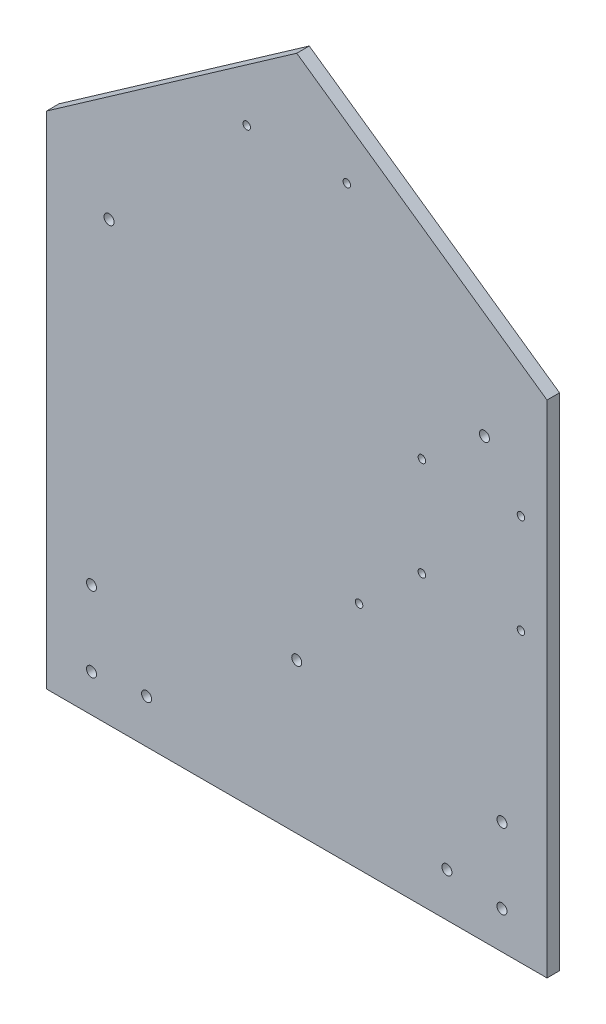
ISO-10303-21;
HEADER;
FILE_DESCRIPTION(('STEP AP214'),'2;1');
FILE_NAME('part.step','',(''),(''),'','','');
FILE_SCHEMA(('AUTOMOTIVE_DESIGN { 1 0 10303 214 1 1 1 1 }'));
ENDSEC;
DATA;
#1=APPLICATION_CONTEXT('core data for automotive mechanical design processes');
#2=APPLICATION_PROTOCOL_DEFINITION('international standard','automotive_design',2000,#1);
#3=PRODUCT_CONTEXT('',#1,'mechanical');
#4=PRODUCT('Part','Part','',(#3));
#5=PRODUCT_RELATED_PRODUCT_CATEGORY('part','',(#4));
#6=PRODUCT_DEFINITION_FORMATION('','',#4);
#7=PRODUCT_DEFINITION_CONTEXT('part definition',#1,'design');
#8=PRODUCT_DEFINITION('design','',#6,#7);
#9=PRODUCT_DEFINITION_SHAPE('','',#8);
#10=(LENGTH_UNIT() NAMED_UNIT(*) SI_UNIT(.MILLI.,.METRE.));
#11=(NAMED_UNIT(*) PLANE_ANGLE_UNIT() SI_UNIT($,.RADIAN.));
#12=(NAMED_UNIT(*) SI_UNIT($,.STERADIAN.) SOLID_ANGLE_UNIT());
#13=UNCERTAINTY_MEASURE_WITH_UNIT(LENGTH_MEASURE(1.E-05),#10,'distance_accuracy_value','');
#14=(GEOMETRIC_REPRESENTATION_CONTEXT(3) GLOBAL_UNCERTAINTY_ASSIGNED_CONTEXT((#13)) GLOBAL_UNIT_ASSIGNED_CONTEXT((#10,
#11,#12)) REPRESENTATION_CONTEXT('',''));
#15=CARTESIAN_POINT('',(0.,0.,0.));
#16=DIRECTION('',(0.,0.,1.));
#17=DIRECTION('',(1.,0.,0.));
#18=AXIS2_PLACEMENT_3D('',#15,#16,#17);
#19=CARTESIAN_POINT('',(0.,0.,5.));
#20=DIRECTION('',(0.,0.,1.));
#21=DIRECTION('',(1.,0.,0.));
#22=AXIS2_PLACEMENT_3D('',#19,#20,#21);
#23=PLANE('',#22);
#24=CARTESIAN_POINT('',(97.1030347467712,19.8717948717949,5.));
#25=DIRECTION('',(0.,0.,1.));
#26=DIRECTION('',(-1.,0.,0.));
#27=AXIS2_PLACEMENT_3D('',#24,#25,#26);
#28=CIRCLE('',#27,1.5);
#29=CARTESIAN_POINT('',(95.6030347467712,19.8717948717949,5.));
#30=VERTEX_POINT('',#29);
#31=EDGE_CURVE('E220',#30,#30,#28,.T.);
#32=ORIENTED_EDGE('',*,*,#31,.F.);
#33=EDGE_LOOP('',(#32));
#34=FACE_BOUND('',#33,.T.);
#35=CARTESIAN_POINT('',(57.5030347467712,19.8717948717949,5.));
#36=DIRECTION('',(0.,0.,1.));
#37=DIRECTION('',(1.,0.,0.));
#38=AXIS2_PLACEMENT_3D('',#35,#36,#37);
#39=CIRCLE('',#38,1.5);
#40=CARTESIAN_POINT('',(59.0030347467712,19.8717948717949,5.));
#41=VERTEX_POINT('',#40);
#42=EDGE_CURVE('E232',#41,#41,#39,.T.);
#43=ORIENTED_EDGE('',*,*,#42,.F.);
#44=EDGE_LOOP('',(#43));
#45=FACE_BOUND('',#44,.T.);
#46=CARTESIAN_POINT('',(-67.4969652532288,79.8717948717949,5.));
#47=DIRECTION('',(0.,0.,1.));
#48=DIRECTION('',(1.,0.,0.));
#49=AXIS2_PLACEMENT_3D('',#46,#47,#48);
#50=CIRCLE('',#49,2.);
#51=CARTESIAN_POINT('',(-65.4969652532288,79.8717948717949,5.));
#52=VERTEX_POINT('',#51);
#53=EDGE_CURVE('E244',#52,#52,#50,.T.);
#54=ORIENTED_EDGE('',*,*,#53,.F.);
#55=EDGE_LOOP('',(#54));
#56=FACE_BOUND('',#55,.T.);
#57=CARTESIAN_POINT('',(-52.4969652532288,-77.6282051282052,5.));
#58=DIRECTION('',(0.,0.,1.));
#59=DIRECTION('',(1.,0.,0.));
#60=AXIS2_PLACEMENT_3D('',#57,#58,#59);
#61=CIRCLE('',#60,2.);
#62=CARTESIAN_POINT('',(-50.4969652532288,-77.6282051282052,5.));
#63=VERTEX_POINT('',#62);
#64=EDGE_CURVE('E256',#63,#63,#61,.T.);
#65=ORIENTED_EDGE('',*,*,#64,.F.);
#66=EDGE_LOOP('',(#65));
#67=FACE_BOUND('',#66,.T.);
#68=CARTESIAN_POINT('',(7.5030347467712,-35.1282051282051,5.));
#69=DIRECTION('',(0.,0.,1.));
#70=DIRECTION('',(1.,0.,0.));
#71=AXIS2_PLACEMENT_3D('',#68,#69,#70);
#72=CIRCLE('',#71,2.);
#73=CARTESIAN_POINT('',(9.5030347467712,-35.1282051282051,5.));
#74=VERTEX_POINT('',#73);
#75=EDGE_CURVE('E268',#74,#74,#72,.T.);
#76=ORIENTED_EDGE('',*,*,#75,.F.);
#77=EDGE_LOOP('',(#76));
#78=FACE_BOUND('',#77,.T.);
#79=CARTESIAN_POINT('',(27.5030347467712,139.871794871795,5.));
#80=DIRECTION('',(0.,0.,1.));
#81=DIRECTION('',(1.,0.,0.));
#82=AXIS2_PLACEMENT_3D('',#79,#80,#81);
#83=CIRCLE('',#82,1.5);
#84=CARTESIAN_POINT('',(29.0030347467712,139.871794871795,5.));
#85=VERTEX_POINT('',#84);
#86=EDGE_CURVE('E280',#85,#85,#83,.T.);
#87=ORIENTED_EDGE('',*,*,#86,.F.);
#88=EDGE_LOOP('',(#87));
#89=FACE_BOUND('',#88,.T.);
#90=CARTESIAN_POINT('',(-74.4969652532289,-50.1282051282052,5.));
#91=DIRECTION('',(0.,0.,1.));
#92=DIRECTION('',(-1.,0.,0.));
#93=AXIS2_PLACEMENT_3D('',#90,#91,#92);
#94=CIRCLE('',#93,2.);
#95=CARTESIAN_POINT('',(-76.4969652532289,-50.1282051282052,5.));
#96=VERTEX_POINT('',#95);
#97=EDGE_CURVE('E292',#96,#96,#94,.T.);
#98=ORIENTED_EDGE('',*,*,#97,.F.);
#99=EDGE_LOOP('',(#98));
#100=FACE_BOUND('',#99,.T.);
#101=CARTESIAN_POINT('',(-74.4969652532289,-80.1282051282052,5.));
#102=DIRECTION('',(0.,0.,1.));
#103=DIRECTION('',(-1.,0.,0.));
#104=AXIS2_PLACEMENT_3D('',#101,#102,#103);
#105=CIRCLE('',#104,2.);
#106=CARTESIAN_POINT('',(-76.4969652532289,-80.1282051282052,5.));
#107=VERTEX_POINT('',#106);
#108=EDGE_CURVE('E112',#107,#107,#105,.T.);
#109=ORIENTED_EDGE('',*,*,#108,.F.);
#110=EDGE_LOOP('',(#109));
#111=FACE_BOUND('',#110,.T.);
#112=DIRECTION('',(0.,1.,0.));
#113=VECTOR('',#112,1.);
#114=CARTESIAN_POINT('',(107.503034746771,104.871794871795,5.));
#115=LINE('',#114,#113);
#116=CARTESIAN_POINT('',(107.503034746771,-95.1282051282052,5.));
#117=VERTEX_POINT('',#116);
#118=CARTESIAN_POINT('',(107.503034746771,104.871794871795,5.));
#119=VERTEX_POINT('',#118);
#120=EDGE_CURVE('E117',#117,#119,#115,.T.);
#121=ORIENTED_EDGE('',*,*,#120,.T.);
#122=DIRECTION('',(-0.81923192051904,0.573462344363329,0.));
#123=VECTOR('',#122,1.);
#124=CARTESIAN_POINT('',(7.5030347467712,174.871794871795,5.));
#125=LINE('',#124,#123);
#126=CARTESIAN_POINT('',(7.5030347467712,174.871794871795,5.));
#127=VERTEX_POINT('',#126);
#128=EDGE_CURVE('E84',#119,#127,#125,.T.);
#129=ORIENTED_EDGE('',*,*,#128,.T.);
#130=DIRECTION('',(-0.81923192051904,-0.573462344363328,0.));
#131=VECTOR('',#130,1.);
#132=CARTESIAN_POINT('',(-92.4969652532288,104.871794871795,5.));
#133=LINE('',#132,#131);
#134=CARTESIAN_POINT('',(-92.4969652532288,104.871794871795,5.));
#135=VERTEX_POINT('',#134);
#136=EDGE_CURVE('E88',#127,#135,#133,.T.);
#137=ORIENTED_EDGE('',*,*,#136,.T.);
#138=DIRECTION('',(0.,-1.,0.));
#139=VECTOR('',#138,1.);
#140=CARTESIAN_POINT('',(-92.4969652532288,104.871794871795,5.));
#141=LINE('',#140,#139);
#142=CARTESIAN_POINT('',(-92.4969652532288,-95.1282051282052,5.));
#143=VERTEX_POINT('',#142);
#144=EDGE_CURVE('E92',#135,#143,#141,.T.);
#145=ORIENTED_EDGE('',*,*,#144,.T.);
#146=DIRECTION('',(1.,0.,0.));
#147=VECTOR('',#146,1.);
#148=CARTESIAN_POINT('',(-92.4969652532288,-95.1282051282052,5.));
#149=LINE('',#148,#147);
#150=EDGE_CURVE('E50',#143,#117,#149,.T.);
#151=ORIENTED_EDGE('',*,*,#150,.T.);
#152=EDGE_LOOP('',(#121,#129,#137,#145,#151));
#153=FACE_BOUND('',#152,.T.);
#154=CARTESIAN_POINT('',(89.5030347467712,-80.1282051282052,5.));
#155=DIRECTION('',(0.,0.,1.));
#156=DIRECTION('',(1.,0.,0.));
#157=AXIS2_PLACEMENT_3D('',#154,#155,#156);
#158=CIRCLE('',#157,2.);
#159=CARTESIAN_POINT('',(91.5030347467712,-80.1282051282052,5.));
#160=VERTEX_POINT('',#159);
#161=EDGE_CURVE('E298',#160,#160,#158,.T.);
#162=ORIENTED_EDGE('',*,*,#161,.F.);
#163=EDGE_LOOP('',(#162));
#164=FACE_BOUND('',#163,.T.);
#165=CARTESIAN_POINT('',(89.5030347467712,-50.1282051282052,5.));
#166=DIRECTION('',(0.,0.,1.));
#167=DIRECTION('',(1.,0.,0.));
#168=AXIS2_PLACEMENT_3D('',#165,#166,#167);
#169=CIRCLE('',#168,2.);
#170=CARTESIAN_POINT('',(91.5030347467712,-50.1282051282052,5.));
#171=VERTEX_POINT('',#170);
#172=EDGE_CURVE('E286',#171,#171,#169,.T.);
#173=ORIENTED_EDGE('',*,*,#172,.F.);
#174=EDGE_LOOP('',(#173));
#175=FACE_BOUND('',#174,.T.);
#176=CARTESIAN_POINT('',(-12.4969652532288,139.871794871795,5.));
#177=DIRECTION('',(0.,0.,1.));
#178=DIRECTION('',(-1.,0.,0.));
#179=AXIS2_PLACEMENT_3D('',#176,#177,#178);
#180=CIRCLE('',#179,1.5);
#181=CARTESIAN_POINT('',(-13.9969652532288,139.871794871795,5.));
#182=VERTEX_POINT('',#181);
#183=EDGE_CURVE('E274',#182,#182,#180,.T.);
#184=ORIENTED_EDGE('',*,*,#183,.F.);
#185=EDGE_LOOP('',(#184));
#186=FACE_BOUND('',#185,.T.);
#187=CARTESIAN_POINT('',(32.4030347467712,-3.12820512820513,5.));
#188=DIRECTION('',(0.,0.,1.));
#189=DIRECTION('',(1.,0.,0.));
#190=AXIS2_PLACEMENT_3D('',#187,#188,#189);
#191=CIRCLE('',#190,1.5);
#192=CARTESIAN_POINT('',(33.9030347467712,-3.12820512820513,5.));
#193=VERTEX_POINT('',#192);
#194=EDGE_CURVE('E262',#193,#193,#191,.T.);
#195=ORIENTED_EDGE('',*,*,#194,.F.);
#196=EDGE_LOOP('',(#195));
#197=FACE_BOUND('',#196,.T.);
#198=CARTESIAN_POINT('',(67.5030347467711,-77.6282051282052,5.));
#199=DIRECTION('',(0.,0.,1.));
#200=DIRECTION('',(-1.,0.,0.));
#201=AXIS2_PLACEMENT_3D('',#198,#199,#200);
#202=CIRCLE('',#201,2.);
#203=CARTESIAN_POINT('',(65.5030347467711,-77.6282051282052,5.));
#204=VERTEX_POINT('',#203);
#205=EDGE_CURVE('E250',#204,#204,#202,.T.);
#206=ORIENTED_EDGE('',*,*,#205,.F.);
#207=EDGE_LOOP('',(#206));
#208=FACE_BOUND('',#207,.T.);
#209=CARTESIAN_POINT('',(82.5030347467711,79.8717948717948,5.));
#210=DIRECTION('',(0.,0.,1.));
#211=DIRECTION('',(-1.,0.,0.));
#212=AXIS2_PLACEMENT_3D('',#209,#210,#211);
#213=CIRCLE('',#212,2.);
#214=CARTESIAN_POINT('',(80.5030347467711,79.8717948717948,5.));
#215=VERTEX_POINT('',#214);
#216=EDGE_CURVE('E238',#215,#215,#213,.T.);
#217=ORIENTED_EDGE('',*,*,#216,.F.);
#218=EDGE_LOOP('',(#217));
#219=FACE_BOUND('',#218,.T.);
#220=CARTESIAN_POINT('',(57.5030347467712,59.4717948717949,5.));
#221=DIRECTION('',(0.,0.,1.));
#222=DIRECTION('',(-1.,0.,0.));
#223=AXIS2_PLACEMENT_3D('',#220,#221,#222);
#224=CIRCLE('',#223,1.5);
#225=CARTESIAN_POINT('',(56.0030347467712,59.4717948717949,5.));
#226=VERTEX_POINT('',#225);
#227=EDGE_CURVE('E226',#226,#226,#224,.T.);
#228=ORIENTED_EDGE('',*,*,#227,.F.);
#229=EDGE_LOOP('',(#228));
#230=FACE_BOUND('',#229,.T.);
#231=CARTESIAN_POINT('',(97.1030347467712,59.4717948717949,5.));
#232=DIRECTION('',(0.,0.,1.));
#233=DIRECTION('',(1.,0.,0.));
#234=AXIS2_PLACEMENT_3D('',#231,#232,#233);
#235=CIRCLE('',#234,1.5);
#236=CARTESIAN_POINT('',(98.6030347467712,59.4717948717949,5.));
#237=VERTEX_POINT('',#236);
#238=EDGE_CURVE('E211',#237,#237,#235,.T.);
#239=ORIENTED_EDGE('',*,*,#238,.F.);
#240=EDGE_LOOP('',(#239));
#241=FACE_BOUND('',#240,.T.);
#242=ADVANCED_FACE('F33',(#34,#45,#56,#67,#78,#89,#100,#111,#153,#164,#175,#186,#197,#208,#219,
#230,#241),#23,.T.);
#243=CARTESIAN_POINT('',(0.,0.,0.));
#244=DIRECTION('',(0.,0.,1.));
#245=DIRECTION('',(1.,0.,0.));
#246=AXIS2_PLACEMENT_3D('',#243,#244,#245);
#247=PLANE('',#246);
#248=DIRECTION('',(0.,1.,0.));
#249=VECTOR('',#248,1.);
#250=CARTESIAN_POINT('',(107.503034746771,104.871794871795,0.));
#251=LINE('',#250,#249);
#252=CARTESIAN_POINT('',(107.503034746771,-95.1282051282052,0.));
#253=VERTEX_POINT('',#252);
#254=CARTESIAN_POINT('',(107.503034746771,104.871794871795,0.));
#255=VERTEX_POINT('',#254);
#256=EDGE_CURVE('E108',#253,#255,#251,.T.);
#257=ORIENTED_EDGE('',*,*,#256,.F.);
#258=DIRECTION('',(1.,0.,0.));
#259=VECTOR('',#258,1.);
#260=CARTESIAN_POINT('',(-92.4969652532288,-95.1282051282052,0.));
#261=LINE('',#260,#259);
#262=CARTESIAN_POINT('',(-92.4969652532288,-95.1282051282052,0.));
#263=VERTEX_POINT('',#262);
#264=EDGE_CURVE('E76',#263,#253,#261,.T.);
#265=ORIENTED_EDGE('',*,*,#264,.F.);
#266=DIRECTION('',(0.,-1.,0.));
#267=VECTOR('',#266,1.);
#268=CARTESIAN_POINT('',(-92.4969652532288,104.871794871795,0.));
#269=LINE('',#268,#267);
#270=CARTESIAN_POINT('',(-92.4969652532288,104.871794871795,0.));
#271=VERTEX_POINT('',#270);
#272=EDGE_CURVE('E70',#271,#263,#269,.T.);
#273=ORIENTED_EDGE('',*,*,#272,.F.);
#274=DIRECTION('',(-0.81923192051904,-0.573462344363328,0.));
#275=VECTOR('',#274,1.);
#276=CARTESIAN_POINT('',(-92.4969652532288,104.871794871795,0.));
#277=LINE('',#276,#275);
#278=CARTESIAN_POINT('',(7.5030347467712,174.871794871795,0.));
#279=VERTEX_POINT('',#278);
#280=EDGE_CURVE('E99',#279,#271,#277,.T.);
#281=ORIENTED_EDGE('',*,*,#280,.F.);
#282=DIRECTION('',(-0.81923192051904,0.573462344363329,0.));
#283=VECTOR('',#282,1.);
#284=CARTESIAN_POINT('',(7.5030347467712,174.871794871795,0.));
#285=LINE('',#284,#283);
#286=EDGE_CURVE('E111',#255,#279,#285,.T.);
#287=ORIENTED_EDGE('',*,*,#286,.F.);
#288=EDGE_LOOP('',(#257,#265,#273,#281,#287));
#289=FACE_BOUND('',#288,.T.);
#290=CARTESIAN_POINT('',(-74.4969652532289,-80.1282051282052,0.));
#291=DIRECTION('',(0.,0.,1.));
#292=DIRECTION('',(-1.,0.,0.));
#293=AXIS2_PLACEMENT_3D('',#290,#291,#292);
#294=CIRCLE('',#293,2.);
#295=CARTESIAN_POINT('',(-76.4969652532289,-80.1282051282052,0.));
#296=VERTEX_POINT('',#295);
#297=EDGE_CURVE('E301',#296,#296,#294,.T.);
#298=ORIENTED_EDGE('',*,*,#297,.T.);
#299=EDGE_LOOP('',(#298));
#300=FACE_BOUND('',#299,.T.);
#301=CARTESIAN_POINT('',(89.5030347467712,-80.1282051282052,0.));
#302=DIRECTION('',(0.,0.,1.));
#303=DIRECTION('',(1.,0.,0.));
#304=AXIS2_PLACEMENT_3D('',#301,#302,#303);
#305=CIRCLE('',#304,2.);
#306=CARTESIAN_POINT('',(91.5030347467712,-80.1282051282052,0.));
#307=VERTEX_POINT('',#306);
#308=EDGE_CURVE('E295',#307,#307,#305,.T.);
#309=ORIENTED_EDGE('',*,*,#308,.T.);
#310=EDGE_LOOP('',(#309));
#311=FACE_BOUND('',#310,.T.);
#312=CARTESIAN_POINT('',(-74.4969652532289,-50.1282051282052,0.));
#313=DIRECTION('',(0.,0.,1.));
#314=DIRECTION('',(-1.,0.,0.));
#315=AXIS2_PLACEMENT_3D('',#312,#313,#314);
#316=CIRCLE('',#315,2.);
#317=CARTESIAN_POINT('',(-76.4969652532289,-50.1282051282052,0.));
#318=VERTEX_POINT('',#317);
#319=EDGE_CURVE('E289',#318,#318,#316,.T.);
#320=ORIENTED_EDGE('',*,*,#319,.T.);
#321=EDGE_LOOP('',(#320));
#322=FACE_BOUND('',#321,.T.);
#323=CARTESIAN_POINT('',(89.5030347467712,-50.1282051282052,0.));
#324=DIRECTION('',(0.,0.,1.));
#325=DIRECTION('',(1.,0.,0.));
#326=AXIS2_PLACEMENT_3D('',#323,#324,#325);
#327=CIRCLE('',#326,2.);
#328=CARTESIAN_POINT('',(91.5030347467712,-50.1282051282052,0.));
#329=VERTEX_POINT('',#328);
#330=EDGE_CURVE('E283',#329,#329,#327,.T.);
#331=ORIENTED_EDGE('',*,*,#330,.T.);
#332=EDGE_LOOP('',(#331));
#333=FACE_BOUND('',#332,.T.);
#334=CARTESIAN_POINT('',(27.5030347467712,139.871794871795,0.));
#335=DIRECTION('',(0.,0.,1.));
#336=DIRECTION('',(1.,0.,0.));
#337=AXIS2_PLACEMENT_3D('',#334,#335,#336);
#338=CIRCLE('',#337,1.5);
#339=CARTESIAN_POINT('',(29.0030347467712,139.871794871795,0.));
#340=VERTEX_POINT('',#339);
#341=EDGE_CURVE('E277',#340,#340,#338,.T.);
#342=ORIENTED_EDGE('',*,*,#341,.T.);
#343=EDGE_LOOP('',(#342));
#344=FACE_BOUND('',#343,.T.);
#345=CARTESIAN_POINT('',(-12.4969652532288,139.871794871795,0.));
#346=DIRECTION('',(0.,0.,1.));
#347=DIRECTION('',(-1.,0.,0.));
#348=AXIS2_PLACEMENT_3D('',#345,#346,#347);
#349=CIRCLE('',#348,1.5);
#350=CARTESIAN_POINT('',(-13.9969652532288,139.871794871795,0.));
#351=VERTEX_POINT('',#350);
#352=EDGE_CURVE('E271',#351,#351,#349,.T.);
#353=ORIENTED_EDGE('',*,*,#352,.T.);
#354=EDGE_LOOP('',(#353));
#355=FACE_BOUND('',#354,.T.);
#356=CARTESIAN_POINT('',(7.5030347467712,-35.1282051282051,0.));
#357=DIRECTION('',(0.,0.,1.));
#358=DIRECTION('',(1.,0.,0.));
#359=AXIS2_PLACEMENT_3D('',#356,#357,#358);
#360=CIRCLE('',#359,2.);
#361=CARTESIAN_POINT('',(9.5030347467712,-35.1282051282051,0.));
#362=VERTEX_POINT('',#361);
#363=EDGE_CURVE('E265',#362,#362,#360,.T.);
#364=ORIENTED_EDGE('',*,*,#363,.T.);
#365=EDGE_LOOP('',(#364));
#366=FACE_BOUND('',#365,.T.);
#367=CARTESIAN_POINT('',(32.4030347467712,-3.12820512820513,0.));
#368=DIRECTION('',(0.,0.,1.));
#369=DIRECTION('',(1.,0.,0.));
#370=AXIS2_PLACEMENT_3D('',#367,#368,#369);
#371=CIRCLE('',#370,1.5);
#372=CARTESIAN_POINT('',(33.9030347467712,-3.12820512820513,0.));
#373=VERTEX_POINT('',#372);
#374=EDGE_CURVE('E259',#373,#373,#371,.T.);
#375=ORIENTED_EDGE('',*,*,#374,.T.);
#376=EDGE_LOOP('',(#375));
#377=FACE_BOUND('',#376,.T.);
#378=CARTESIAN_POINT('',(-52.4969652532288,-77.6282051282052,0.));
#379=DIRECTION('',(0.,0.,1.));
#380=DIRECTION('',(1.,0.,0.));
#381=AXIS2_PLACEMENT_3D('',#378,#379,#380);
#382=CIRCLE('',#381,2.);
#383=CARTESIAN_POINT('',(-50.4969652532288,-77.6282051282052,0.));
#384=VERTEX_POINT('',#383);
#385=EDGE_CURVE('E253',#384,#384,#382,.T.);
#386=ORIENTED_EDGE('',*,*,#385,.T.);
#387=EDGE_LOOP('',(#386));
#388=FACE_BOUND('',#387,.T.);
#389=CARTESIAN_POINT('',(67.5030347467711,-77.6282051282052,0.));
#390=DIRECTION('',(0.,0.,1.));
#391=DIRECTION('',(-1.,0.,0.));
#392=AXIS2_PLACEMENT_3D('',#389,#390,#391);
#393=CIRCLE('',#392,2.);
#394=CARTESIAN_POINT('',(65.5030347467711,-77.6282051282052,0.));
#395=VERTEX_POINT('',#394);
#396=EDGE_CURVE('E247',#395,#395,#393,.T.);
#397=ORIENTED_EDGE('',*,*,#396,.T.);
#398=EDGE_LOOP('',(#397));
#399=FACE_BOUND('',#398,.T.);
#400=CARTESIAN_POINT('',(-67.4969652532288,79.8717948717949,0.));
#401=DIRECTION('',(0.,0.,1.));
#402=DIRECTION('',(1.,0.,0.));
#403=AXIS2_PLACEMENT_3D('',#400,#401,#402);
#404=CIRCLE('',#403,2.);
#405=CARTESIAN_POINT('',(-65.4969652532288,79.8717948717949,0.));
#406=VERTEX_POINT('',#405);
#407=EDGE_CURVE('E241',#406,#406,#404,.T.);
#408=ORIENTED_EDGE('',*,*,#407,.T.);
#409=EDGE_LOOP('',(#408));
#410=FACE_BOUND('',#409,.T.);
#411=CARTESIAN_POINT('',(82.5030347467711,79.8717948717948,0.));
#412=DIRECTION('',(0.,0.,1.));
#413=DIRECTION('',(-1.,0.,0.));
#414=AXIS2_PLACEMENT_3D('',#411,#412,#413);
#415=CIRCLE('',#414,2.);
#416=CARTESIAN_POINT('',(80.5030347467711,79.8717948717948,0.));
#417=VERTEX_POINT('',#416);
#418=EDGE_CURVE('E235',#417,#417,#415,.T.);
#419=ORIENTED_EDGE('',*,*,#418,.T.);
#420=EDGE_LOOP('',(#419));
#421=FACE_BOUND('',#420,.T.);
#422=CARTESIAN_POINT('',(57.5030347467712,19.8717948717949,0.));
#423=DIRECTION('',(0.,0.,1.));
#424=DIRECTION('',(1.,0.,0.));
#425=AXIS2_PLACEMENT_3D('',#422,#423,#424);
#426=CIRCLE('',#425,1.5);
#427=CARTESIAN_POINT('',(59.0030347467712,19.8717948717949,0.));
#428=VERTEX_POINT('',#427);
#429=EDGE_CURVE('E229',#428,#428,#426,.T.);
#430=ORIENTED_EDGE('',*,*,#429,.T.);
#431=EDGE_LOOP('',(#430));
#432=FACE_BOUND('',#431,.T.);
#433=CARTESIAN_POINT('',(57.5030347467712,59.4717948717949,0.));
#434=DIRECTION('',(0.,0.,1.));
#435=DIRECTION('',(-1.,0.,0.));
#436=AXIS2_PLACEMENT_3D('',#433,#434,#435);
#437=CIRCLE('',#436,1.5);
#438=CARTESIAN_POINT('',(56.0030347467712,59.4717948717949,0.));
#439=VERTEX_POINT('',#438);
#440=EDGE_CURVE('E223',#439,#439,#437,.T.);
#441=ORIENTED_EDGE('',*,*,#440,.T.);
#442=EDGE_LOOP('',(#441));
#443=FACE_BOUND('',#442,.T.);
#444=CARTESIAN_POINT('',(97.1030347467712,19.8717948717949,0.));
#445=DIRECTION('',(0.,0.,1.));
#446=DIRECTION('',(-1.,0.,0.));
#447=AXIS2_PLACEMENT_3D('',#444,#445,#446);
#448=CIRCLE('',#447,1.5);
#449=CARTESIAN_POINT('',(95.6030347467712,19.8717948717949,0.));
#450=VERTEX_POINT('',#449);
#451=EDGE_CURVE('E217',#450,#450,#448,.T.);
#452=ORIENTED_EDGE('',*,*,#451,.T.);
#453=EDGE_LOOP('',(#452));
#454=FACE_BOUND('',#453,.T.);
#455=CARTESIAN_POINT('',(97.1030347467712,59.4717948717949,0.));
#456=DIRECTION('',(0.,0.,1.));
#457=DIRECTION('',(1.,0.,0.));
#458=AXIS2_PLACEMENT_3D('',#455,#456,#457);
#459=CIRCLE('',#458,1.5);
#460=CARTESIAN_POINT('',(98.6030347467712,59.4717948717949,0.));
#461=VERTEX_POINT('',#460);
#462=EDGE_CURVE('E214',#461,#461,#459,.T.);
#463=ORIENTED_EDGE('',*,*,#462,.T.);
#464=EDGE_LOOP('',(#463));
#465=FACE_BOUND('',#464,.T.);
#466=ADVANCED_FACE('F121',(#289,#300,#311,#322,#333,#344,#355,#366,#377,#388,#399,#410,#421,
#432,#443,#454,#465),#247,.F.);
#467=CARTESIAN_POINT('',(107.503034746771,104.871794871795,5.));
#468=DIRECTION('',(-1.,0.,0.));
#469=DIRECTION('',(0.,-1.,0.));
#470=AXIS2_PLACEMENT_3D('',#467,#468,#469);
#471=PLANE('',#470);
#472=ORIENTED_EDGE('',*,*,#256,.T.);
#473=DIRECTION('',(0.,0.,-1.));
#474=VECTOR('',#473,1.);
#475=CARTESIAN_POINT('',(107.503034746771,104.871794871795,5.));
#476=LINE('',#475,#474);
#477=EDGE_CURVE('E11',#119,#255,#476,.T.);
#478=ORIENTED_EDGE('',*,*,#477,.F.);
#479=ORIENTED_EDGE('',*,*,#120,.F.);
#480=DIRECTION('',(0.,0.,-1.));
#481=VECTOR('',#480,1.);
#482=CARTESIAN_POINT('',(107.503034746771,-95.1282051282052,5.));
#483=LINE('',#482,#481);
#484=EDGE_CURVE('E104',#117,#253,#483,.T.);
#485=ORIENTED_EDGE('',*,*,#484,.T.);
#486=EDGE_LOOP('',(#472,#478,#479,#485));
#487=FACE_BOUND('',#486,.T.);
#488=ADVANCED_FACE('F35',(#487),#471,.F.);
#489=CARTESIAN_POINT('',(7.5030347467712,174.871794871795,5.));
#490=DIRECTION('',(-0.573462344363329,-0.81923192051904,0.));
#491=DIRECTION('',(0.81923192051904,-0.573462344363329,0.));
#492=AXIS2_PLACEMENT_3D('',#489,#490,#491);
#493=PLANE('',#492);
#494=ORIENTED_EDGE('',*,*,#286,.T.);
#495=DIRECTION('',(0.,0.,-1.));
#496=VECTOR('',#495,1.);
#497=CARTESIAN_POINT('',(7.5030347467712,174.871794871795,5.));
#498=LINE('',#497,#496);
#499=EDGE_CURVE('E42',#127,#279,#498,.T.);
#500=ORIENTED_EDGE('',*,*,#499,.F.);
#501=ORIENTED_EDGE('',*,*,#128,.F.);
#502=ORIENTED_EDGE('',*,*,#477,.T.);
#503=EDGE_LOOP('',(#494,#500,#501,#502));
#504=FACE_BOUND('',#503,.T.);
#505=ADVANCED_FACE('F458',(#504),#493,.F.);
#506=CARTESIAN_POINT('',(-92.4969652532288,104.871794871795,5.));
#507=DIRECTION('',(0.573462344363328,-0.81923192051904,0.));
#508=DIRECTION('',(0.81923192051904,0.573462344363328,0.));
#509=AXIS2_PLACEMENT_3D('',#506,#507,#508);
#510=PLANE('',#509);
#511=ORIENTED_EDGE('',*,*,#280,.T.);
#512=DIRECTION('',(0.,0.,-1.));
#513=VECTOR('',#512,1.);
#514=CARTESIAN_POINT('',(-92.4969652532288,104.871794871795,5.));
#515=LINE('',#514,#513);
#516=EDGE_CURVE('E96',#135,#271,#515,.T.);
#517=ORIENTED_EDGE('',*,*,#516,.F.);
#518=ORIENTED_EDGE('',*,*,#136,.F.);
#519=ORIENTED_EDGE('',*,*,#499,.T.);
#520=EDGE_LOOP('',(#511,#517,#518,#519));
#521=FACE_BOUND('',#520,.T.);
#522=ADVANCED_FACE('F97',(#521),#510,.F.);
#523=CARTESIAN_POINT('',(-92.4969652532288,104.871794871795,5.));
#524=DIRECTION('',(1.,0.,0.));
#525=DIRECTION('',(0.,1.,0.));
#526=AXIS2_PLACEMENT_3D('',#523,#524,#525);
#527=PLANE('',#526);
#528=ORIENTED_EDGE('',*,*,#272,.T.);
#529=DIRECTION('',(0.,0.,-1.));
#530=VECTOR('',#529,1.);
#531=CARTESIAN_POINT('',(-92.4969652532288,-95.1282051282052,5.));
#532=LINE('',#531,#530);
#533=EDGE_CURVE('E100',#143,#263,#532,.T.);
#534=ORIENTED_EDGE('',*,*,#533,.F.);
#535=ORIENTED_EDGE('',*,*,#144,.F.);
#536=ORIENTED_EDGE('',*,*,#516,.T.);
#537=EDGE_LOOP('',(#528,#534,#535,#536));
#538=FACE_BOUND('',#537,.T.);
#539=ADVANCED_FACE('F102',(#538),#527,.F.);
#540=CARTESIAN_POINT('',(-92.4969652532288,-95.1282051282052,5.));
#541=DIRECTION('',(0.,1.,0.));
#542=DIRECTION('',(0.,0.,1.));
#543=AXIS2_PLACEMENT_3D('',#540,#541,#542);
#544=PLANE('',#543);
#545=ORIENTED_EDGE('',*,*,#264,.T.);
#546=ORIENTED_EDGE('',*,*,#484,.F.);
#547=ORIENTED_EDGE('',*,*,#150,.F.);
#548=ORIENTED_EDGE('',*,*,#533,.T.);
#549=EDGE_LOOP('',(#545,#546,#547,#548));
#550=FACE_BOUND('',#549,.T.);
#551=ADVANCED_FACE('F126',(#550),#544,.F.);
#552=CARTESIAN_POINT('',(-74.4969652532289,-80.1282051282052,5.));
#553=DIRECTION('',(0.,0.,-1.));
#554=DIRECTION('',(-1.,0.,0.));
#555=AXIS2_PLACEMENT_3D('',#552,#553,#554);
#556=CYLINDRICAL_SURFACE('',#555,2.);
#557=ORIENTED_EDGE('',*,*,#108,.T.);
#558=EDGE_LOOP('',(#557));
#559=FACE_BOUND('',#558,.T.);
#560=ORIENTED_EDGE('',*,*,#297,.F.);
#561=EDGE_LOOP('',(#560));
#562=FACE_BOUND('',#561,.T.);
#563=ADVANCED_FACE('F128',(#559,#562),#556,.F.);
#564=CARTESIAN_POINT('',(89.5030347467712,-80.1282051282052,5.));
#565=DIRECTION('',(0.,0.,-1.));
#566=DIRECTION('',(-1.,0.,0.));
#567=AXIS2_PLACEMENT_3D('',#564,#565,#566);
#568=CYLINDRICAL_SURFACE('',#567,2.);
#569=ORIENTED_EDGE('',*,*,#161,.T.);
#570=EDGE_LOOP('',(#569));
#571=FACE_BOUND('',#570,.T.);
#572=ORIENTED_EDGE('',*,*,#308,.F.);
#573=EDGE_LOOP('',(#572));
#574=FACE_BOUND('',#573,.T.);
#575=ADVANCED_FACE('F134',(#571,#574),#568,.F.);
#576=CARTESIAN_POINT('',(-74.4969652532289,-50.1282051282052,5.));
#577=DIRECTION('',(0.,0.,-1.));
#578=DIRECTION('',(-1.,0.,0.));
#579=AXIS2_PLACEMENT_3D('',#576,#577,#578);
#580=CYLINDRICAL_SURFACE('',#579,2.);
#581=ORIENTED_EDGE('',*,*,#97,.T.);
#582=EDGE_LOOP('',(#581));
#583=FACE_BOUND('',#582,.T.);
#584=ORIENTED_EDGE('',*,*,#319,.F.);
#585=EDGE_LOOP('',(#584));
#586=FACE_BOUND('',#585,.T.);
#587=ADVANCED_FACE('F150',(#583,#586),#580,.F.);
#588=CARTESIAN_POINT('',(89.5030347467712,-50.1282051282052,5.));
#589=DIRECTION('',(0.,0.,-1.));
#590=DIRECTION('',(-1.,0.,0.));
#591=AXIS2_PLACEMENT_3D('',#588,#589,#590);
#592=CYLINDRICAL_SURFACE('',#591,2.);
#593=ORIENTED_EDGE('',*,*,#172,.T.);
#594=EDGE_LOOP('',(#593));
#595=FACE_BOUND('',#594,.T.);
#596=ORIENTED_EDGE('',*,*,#330,.F.);
#597=EDGE_LOOP('',(#596));
#598=FACE_BOUND('',#597,.T.);
#599=ADVANCED_FACE('F154',(#595,#598),#592,.F.);
#600=CARTESIAN_POINT('',(27.5030347467712,139.871794871795,5.));
#601=DIRECTION('',(0.,0.,-1.));
#602=DIRECTION('',(-1.,0.,0.));
#603=AXIS2_PLACEMENT_3D('',#600,#601,#602);
#604=CYLINDRICAL_SURFACE('',#603,1.5);
#605=ORIENTED_EDGE('',*,*,#86,.T.);
#606=EDGE_LOOP('',(#605));
#607=FACE_BOUND('',#606,.T.);
#608=ORIENTED_EDGE('',*,*,#341,.F.);
#609=EDGE_LOOP('',(#608));
#610=FACE_BOUND('',#609,.T.);
#611=ADVANCED_FACE('F158',(#607,#610),#604,.F.);
#612=CARTESIAN_POINT('',(-12.4969652532288,139.871794871795,5.));
#613=DIRECTION('',(0.,0.,-1.));
#614=DIRECTION('',(-1.,0.,0.));
#615=AXIS2_PLACEMENT_3D('',#612,#613,#614);
#616=CYLINDRICAL_SURFACE('',#615,1.5);
#617=ORIENTED_EDGE('',*,*,#183,.T.);
#618=EDGE_LOOP('',(#617));
#619=FACE_BOUND('',#618,.T.);
#620=ORIENTED_EDGE('',*,*,#352,.F.);
#621=EDGE_LOOP('',(#620));
#622=FACE_BOUND('',#621,.T.);
#623=ADVANCED_FACE('F162',(#619,#622),#616,.F.);
#624=CARTESIAN_POINT('',(7.5030347467712,-35.1282051282051,5.));
#625=DIRECTION('',(0.,0.,-1.));
#626=DIRECTION('',(-1.,0.,0.));
#627=AXIS2_PLACEMENT_3D('',#624,#625,#626);
#628=CYLINDRICAL_SURFACE('',#627,2.);
#629=ORIENTED_EDGE('',*,*,#75,.T.);
#630=EDGE_LOOP('',(#629));
#631=FACE_BOUND('',#630,.T.);
#632=ORIENTED_EDGE('',*,*,#363,.F.);
#633=EDGE_LOOP('',(#632));
#634=FACE_BOUND('',#633,.T.);
#635=ADVANCED_FACE('F166',(#631,#634),#628,.F.);
#636=CARTESIAN_POINT('',(32.4030347467712,-3.12820512820513,5.));
#637=DIRECTION('',(0.,0.,-1.));
#638=DIRECTION('',(-1.,0.,0.));
#639=AXIS2_PLACEMENT_3D('',#636,#637,#638);
#640=CYLINDRICAL_SURFACE('',#639,1.5);
#641=ORIENTED_EDGE('',*,*,#194,.T.);
#642=EDGE_LOOP('',(#641));
#643=FACE_BOUND('',#642,.T.);
#644=ORIENTED_EDGE('',*,*,#374,.F.);
#645=EDGE_LOOP('',(#644));
#646=FACE_BOUND('',#645,.T.);
#647=ADVANCED_FACE('F170',(#643,#646),#640,.F.);
#648=CARTESIAN_POINT('',(-52.4969652532288,-77.6282051282052,5.));
#649=DIRECTION('',(0.,0.,-1.));
#650=DIRECTION('',(-1.,0.,0.));
#651=AXIS2_PLACEMENT_3D('',#648,#649,#650);
#652=CYLINDRICAL_SURFACE('',#651,2.);
#653=ORIENTED_EDGE('',*,*,#64,.T.);
#654=EDGE_LOOP('',(#653));
#655=FACE_BOUND('',#654,.T.);
#656=ORIENTED_EDGE('',*,*,#385,.F.);
#657=EDGE_LOOP('',(#656));
#658=FACE_BOUND('',#657,.T.);
#659=ADVANCED_FACE('F174',(#655,#658),#652,.F.);
#660=CARTESIAN_POINT('',(67.5030347467711,-77.6282051282052,5.));
#661=DIRECTION('',(0.,0.,-1.));
#662=DIRECTION('',(-1.,0.,0.));
#663=AXIS2_PLACEMENT_3D('',#660,#661,#662);
#664=CYLINDRICAL_SURFACE('',#663,2.);
#665=ORIENTED_EDGE('',*,*,#205,.T.);
#666=EDGE_LOOP('',(#665));
#667=FACE_BOUND('',#666,.T.);
#668=ORIENTED_EDGE('',*,*,#396,.F.);
#669=EDGE_LOOP('',(#668));
#670=FACE_BOUND('',#669,.T.);
#671=ADVANCED_FACE('F178',(#667,#670),#664,.F.);
#672=CARTESIAN_POINT('',(-67.4969652532288,79.8717948717949,5.));
#673=DIRECTION('',(0.,0.,-1.));
#674=DIRECTION('',(-1.,0.,0.));
#675=AXIS2_PLACEMENT_3D('',#672,#673,#674);
#676=CYLINDRICAL_SURFACE('',#675,2.);
#677=ORIENTED_EDGE('',*,*,#53,.T.);
#678=EDGE_LOOP('',(#677));
#679=FACE_BOUND('',#678,.T.);
#680=ORIENTED_EDGE('',*,*,#407,.F.);
#681=EDGE_LOOP('',(#680));
#682=FACE_BOUND('',#681,.T.);
#683=ADVANCED_FACE('F182',(#679,#682),#676,.F.);
#684=CARTESIAN_POINT('',(82.5030347467711,79.8717948717948,5.));
#685=DIRECTION('',(0.,0.,-1.));
#686=DIRECTION('',(-1.,0.,0.));
#687=AXIS2_PLACEMENT_3D('',#684,#685,#686);
#688=CYLINDRICAL_SURFACE('',#687,2.);
#689=ORIENTED_EDGE('',*,*,#216,.T.);
#690=EDGE_LOOP('',(#689));
#691=FACE_BOUND('',#690,.T.);
#692=ORIENTED_EDGE('',*,*,#418,.F.);
#693=EDGE_LOOP('',(#692));
#694=FACE_BOUND('',#693,.T.);
#695=ADVANCED_FACE('F186',(#691,#694),#688,.F.);
#696=CARTESIAN_POINT('',(57.5030347467712,19.8717948717949,5.));
#697=DIRECTION('',(0.,0.,-1.));
#698=DIRECTION('',(-1.,0.,0.));
#699=AXIS2_PLACEMENT_3D('',#696,#697,#698);
#700=CYLINDRICAL_SURFACE('',#699,1.5);
#701=ORIENTED_EDGE('',*,*,#42,.T.);
#702=EDGE_LOOP('',(#701));
#703=FACE_BOUND('',#702,.T.);
#704=ORIENTED_EDGE('',*,*,#429,.F.);
#705=EDGE_LOOP('',(#704));
#706=FACE_BOUND('',#705,.T.);
#707=ADVANCED_FACE('F190',(#703,#706),#700,.F.);
#708=CARTESIAN_POINT('',(57.5030347467712,59.4717948717949,5.));
#709=DIRECTION('',(0.,0.,-1.));
#710=DIRECTION('',(-1.,0.,0.));
#711=AXIS2_PLACEMENT_3D('',#708,#709,#710);
#712=CYLINDRICAL_SURFACE('',#711,1.5);
#713=ORIENTED_EDGE('',*,*,#227,.T.);
#714=EDGE_LOOP('',(#713));
#715=FACE_BOUND('',#714,.T.);
#716=ORIENTED_EDGE('',*,*,#440,.F.);
#717=EDGE_LOOP('',(#716));
#718=FACE_BOUND('',#717,.T.);
#719=ADVANCED_FACE('F194',(#715,#718),#712,.F.);
#720=CARTESIAN_POINT('',(97.1030347467712,19.8717948717949,5.));
#721=DIRECTION('',(0.,0.,-1.));
#722=DIRECTION('',(-1.,0.,0.));
#723=AXIS2_PLACEMENT_3D('',#720,#721,#722);
#724=CYLINDRICAL_SURFACE('',#723,1.5);
#725=ORIENTED_EDGE('',*,*,#31,.T.);
#726=EDGE_LOOP('',(#725));
#727=FACE_BOUND('',#726,.T.);
#728=ORIENTED_EDGE('',*,*,#451,.F.);
#729=EDGE_LOOP('',(#728));
#730=FACE_BOUND('',#729,.T.);
#731=ADVANCED_FACE('F198',(#727,#730),#724,.F.);
#732=CARTESIAN_POINT('',(97.1030347467712,59.4717948717949,5.));
#733=DIRECTION('',(0.,0.,-1.));
#734=DIRECTION('',(-1.,0.,0.));
#735=AXIS2_PLACEMENT_3D('',#732,#733,#734);
#736=CYLINDRICAL_SURFACE('',#735,1.5);
#737=ORIENTED_EDGE('',*,*,#238,.T.);
#738=EDGE_LOOP('',(#737));
#739=FACE_BOUND('',#738,.T.);
#740=ORIENTED_EDGE('',*,*,#462,.F.);
#741=EDGE_LOOP('',(#740));
#742=FACE_BOUND('',#741,.T.);
#743=ADVANCED_FACE('F202',(#739,#742),#736,.F.);
#744=CLOSED_SHELL('',(#242,#466,#488,#505,#522,#539,#551,#563,#575,#587,#599,#611,#623,#635,
#647,#659,#671,#683,#695,#707,#719,#731,#743));
#745=MANIFOLD_SOLID_BREP('B2',#744);
#746=ADVANCED_BREP_SHAPE_REPRESENTATION('',(#18,#745),#14);
#747=SHAPE_DEFINITION_REPRESENTATION(#9,#746);
ENDSEC;
END-ISO-10303-21;
